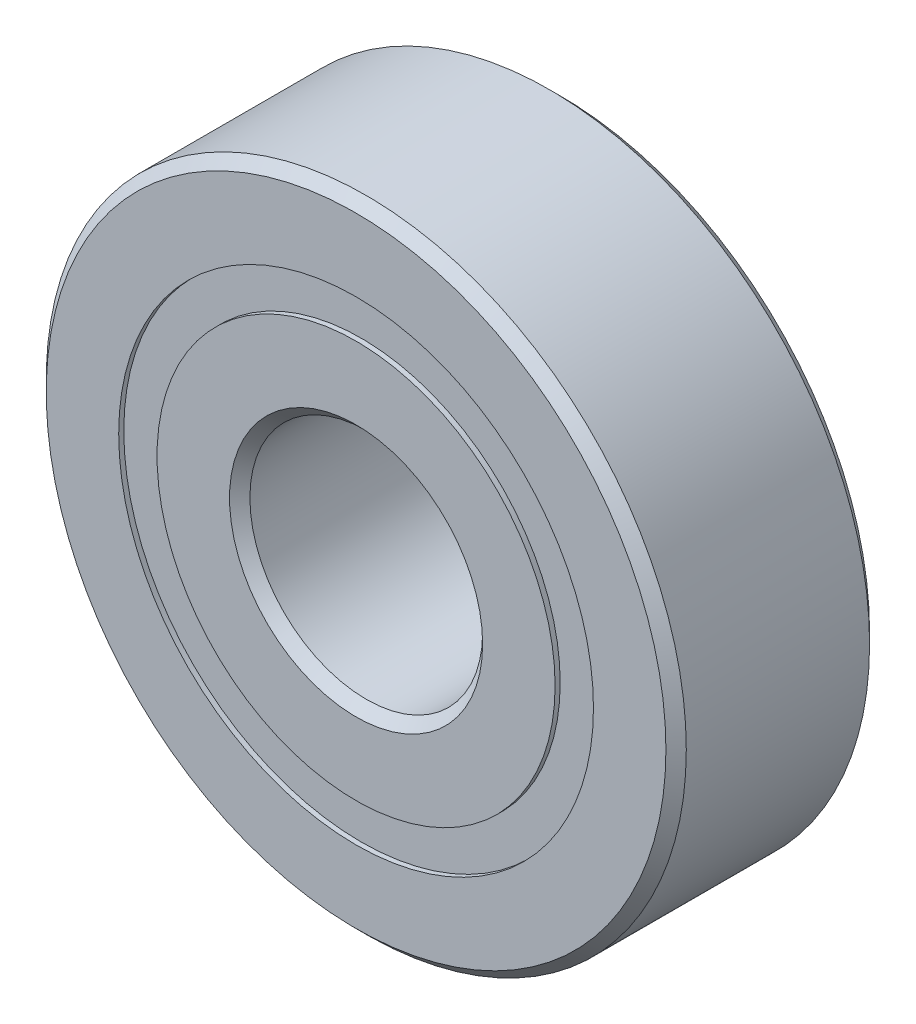
ISO-10303-21;
HEADER;
FILE_DESCRIPTION(('STEP AP214'),'2;1');
FILE_NAME('part.step','',(''),(''),'','','');
FILE_SCHEMA(('AUTOMOTIVE_DESIGN { 1 0 10303 214 1 1 1 1 }'));
ENDSEC;
DATA;
#1=APPLICATION_CONTEXT('core data for automotive mechanical design processes');
#2=APPLICATION_PROTOCOL_DEFINITION('international standard','automotive_design',2000,#1);
#3=PRODUCT_CONTEXT('',#1,'mechanical');
#4=PRODUCT('Part','Part','',(#3));
#5=PRODUCT_RELATED_PRODUCT_CATEGORY('part','',(#4));
#6=PRODUCT_DEFINITION_FORMATION('','',#4);
#7=PRODUCT_DEFINITION_CONTEXT('part definition',#1,'design');
#8=PRODUCT_DEFINITION('design','',#6,#7);
#9=PRODUCT_DEFINITION_SHAPE('','',#8);
#10=(LENGTH_UNIT() NAMED_UNIT(*) SI_UNIT(.MILLI.,.METRE.));
#11=(NAMED_UNIT(*) PLANE_ANGLE_UNIT() SI_UNIT($,.RADIAN.));
#12=(NAMED_UNIT(*) SI_UNIT($,.STERADIAN.) SOLID_ANGLE_UNIT());
#13=UNCERTAINTY_MEASURE_WITH_UNIT(LENGTH_MEASURE(1.E-05),#10,'distance_accuracy_value','');
#14=(GEOMETRIC_REPRESENTATION_CONTEXT(3) GLOBAL_UNCERTAINTY_ASSIGNED_CONTEXT((#13)) GLOBAL_UNIT_ASSIGNED_CONTEXT((#10,
#11,#12)) REPRESENTATION_CONTEXT('',''));
#15=CARTESIAN_POINT('',(0.,0.,0.));
#16=DIRECTION('',(0.,0.,1.));
#17=DIRECTION('',(1.,0.,0.));
#18=AXIS2_PLACEMENT_3D('',#15,#16,#17);
#19=CARTESIAN_POINT('',(0.,8.15934065934066,-3.325));
#20=DIRECTION('',(0.,0.,1.));
#21=DIRECTION('',(1.,0.,0.));
#22=AXIS2_PLACEMENT_3D('',#19,#20,#21);
#23=PLANE('',#22);
#24=CARTESIAN_POINT('',(0.,0.,-3.325));
#25=DIRECTION('',(0.,0.,1.));
#26=DIRECTION('',(1.,0.,0.));
#27=AXIS2_PLACEMENT_3D('',#24,#25,#26);
#28=CIRCLE('',#27,8.15934065934066);
#29=CARTESIAN_POINT('',(8.15934065934066,0.,-3.325));
#30=VERTEX_POINT('',#29);
#31=EDGE_CURVE('E55',#30,#30,#28,.T.);
#32=ORIENTED_EDGE('',*,*,#31,.F.);
#33=EDGE_LOOP('',(#32));
#34=FACE_BOUND('',#33,.T.);
#35=CARTESIAN_POINT('',(0.,0.,-3.325));
#36=DIRECTION('',(0.,0.,1.));
#37=DIRECTION('',(1.,0.,0.));
#38=AXIS2_PLACEMENT_3D('',#35,#36,#37);
#39=CIRCLE('',#38,6.84065934065934);
#40=CARTESIAN_POINT('',(6.84065934065934,0.,-3.325));
#41=VERTEX_POINT('',#40);
#42=EDGE_CURVE('E11',#41,#41,#39,.T.);
#43=ORIENTED_EDGE('',*,*,#42,.T.);
#44=EDGE_LOOP('',(#43));
#45=FACE_BOUND('',#44,.T.);
#46=ADVANCED_FACE('F41',(#34,#45),#23,.F.);
#47=CARTESIAN_POINT('',(0.,0.,3.5));
#48=DIRECTION('',(0.,0.,1.));
#49=DIRECTION('',(1.,0.,0.));
#50=AXIS2_PLACEMENT_3D('',#47,#48,#49);
#51=CYLINDRICAL_SURFACE('',#50,6.84065934065934);
#52=ORIENTED_EDGE('',*,*,#42,.F.);
#53=EDGE_LOOP('',(#52));
#54=FACE_BOUND('',#53,.T.);
#55=CARTESIAN_POINT('',(0.,0.,-1.68952158656808));
#56=DIRECTION('',(0.,0.,1.));
#57=DIRECTION('',(1.,0.,0.));
#58=AXIS2_PLACEMENT_3D('',#55,#56,#57);
#59=CIRCLE('',#58,6.84065934065934);
#60=CARTESIAN_POINT('',(6.84065934065934,0.,-1.68952158656808));
#61=VERTEX_POINT('',#60);
#62=EDGE_CURVE('E47',#61,#61,#59,.T.);
#63=ORIENTED_EDGE('',*,*,#62,.T.);
#64=EDGE_LOOP('',(#63));
#65=FACE_BOUND('',#64,.T.);
#66=ADVANCED_FACE('F64',(#54,#65),#51,.F.);
#67=CARTESIAN_POINT('',(0.,8.15934065934066,-1.68952158656808));
#68=DIRECTION('',(0.,0.,-1.));
#69=DIRECTION('',(-1.,0.,0.));
#70=AXIS2_PLACEMENT_3D('',#67,#68,#69);
#71=PLANE('',#70);
#72=ORIENTED_EDGE('',*,*,#62,.F.);
#73=EDGE_LOOP('',(#72));
#74=FACE_BOUND('',#73,.T.);
#75=CARTESIAN_POINT('',(0.,0.,-1.68952158656808));
#76=DIRECTION('',(0.,0.,1.));
#77=DIRECTION('',(1.,0.,0.));
#78=AXIS2_PLACEMENT_3D('',#75,#76,#77);
#79=CIRCLE('',#78,8.15934065934066);
#80=CARTESIAN_POINT('',(8.15934065934066,0.,-1.68952158656808));
#81=VERTEX_POINT('',#80);
#82=EDGE_CURVE('E51',#81,#81,#79,.T.);
#83=ORIENTED_EDGE('',*,*,#82,.T.);
#84=EDGE_LOOP('',(#83));
#85=FACE_BOUND('',#84,.T.);
#86=ADVANCED_FACE('F68',(#74,#85),#71,.F.);
#87=CARTESIAN_POINT('',(0.,0.,3.5));
#88=DIRECTION('',(0.,0.,1.));
#89=DIRECTION('',(1.,0.,0.));
#90=AXIS2_PLACEMENT_3D('',#87,#88,#89);
#91=CYLINDRICAL_SURFACE('',#90,8.15934065934066);
#92=ORIENTED_EDGE('',*,*,#82,.F.);
#93=EDGE_LOOP('',(#92));
#94=FACE_BOUND('',#93,.T.);
#95=ORIENTED_EDGE('',*,*,#31,.T.);
#96=EDGE_LOOP('',(#95));
#97=FACE_BOUND('',#96,.T.);
#98=ADVANCED_FACE('F61',(#94,#97),#91,.T.);
#99=CLOSED_SHELL('',(#46,#66,#86,#98));
#100=MANIFOLD_SOLID_BREP('B2',#99);
#101=CARTESIAN_POINT('',(0.,8.15934065934066,3.325));
#102=DIRECTION('',(0.,0.,-1.));
#103=DIRECTION('',(-1.,0.,0.));
#104=AXIS2_PLACEMENT_3D('',#101,#102,#103);
#105=PLANE('',#104);
#106=CARTESIAN_POINT('',(0.,0.,3.325));
#107=DIRECTION('',(0.,0.,1.));
#108=DIRECTION('',(1.,0.,0.));
#109=AXIS2_PLACEMENT_3D('',#106,#107,#108);
#110=CIRCLE('',#109,6.84065934065934);
#111=CARTESIAN_POINT('',(6.84065934065934,0.,3.325));
#112=VERTEX_POINT('',#111);
#113=EDGE_CURVE('E40',#112,#112,#110,.T.);
#114=ORIENTED_EDGE('',*,*,#113,.F.);
#115=EDGE_LOOP('',(#114));
#116=FACE_BOUND('',#115,.T.);
#117=CARTESIAN_POINT('',(0.,0.,3.325));
#118=DIRECTION('',(0.,0.,1.));
#119=DIRECTION('',(1.,0.,0.));
#120=AXIS2_PLACEMENT_3D('',#117,#118,#119);
#121=CIRCLE('',#120,8.15934065934066);
#122=CARTESIAN_POINT('',(8.15934065934066,0.,3.325));
#123=VERTEX_POINT('',#122);
#124=EDGE_CURVE('E122',#123,#123,#121,.T.);
#125=ORIENTED_EDGE('',*,*,#124,.T.);
#126=EDGE_LOOP('',(#125));
#127=FACE_BOUND('',#126,.T.);
#128=ADVANCED_FACE('F108',(#116,#127),#105,.F.);
#129=CARTESIAN_POINT('',(0.,0.,3.5));
#130=DIRECTION('',(0.,0.,1.));
#131=DIRECTION('',(1.,0.,0.));
#132=AXIS2_PLACEMENT_3D('',#129,#130,#131);
#133=CYLINDRICAL_SURFACE('',#132,6.84065934065934);
#134=CARTESIAN_POINT('',(0.,0.,1.68952158656808));
#135=DIRECTION('',(0.,0.,1.));
#136=DIRECTION('',(1.,0.,0.));
#137=AXIS2_PLACEMENT_3D('',#134,#135,#136);
#138=CIRCLE('',#137,6.84065934065934);
#139=CARTESIAN_POINT('',(6.84065934065934,0.,1.68952158656808));
#140=VERTEX_POINT('',#139);
#141=EDGE_CURVE('E114',#140,#140,#138,.T.);
#142=ORIENTED_EDGE('',*,*,#141,.F.);
#143=EDGE_LOOP('',(#142));
#144=FACE_BOUND('',#143,.T.);
#145=ORIENTED_EDGE('',*,*,#113,.T.);
#146=EDGE_LOOP('',(#145));
#147=FACE_BOUND('',#146,.T.);
#148=ADVANCED_FACE('F137',(#144,#147),#133,.F.);
#149=CARTESIAN_POINT('',(0.,8.15934065934066,1.68952158656808));
#150=DIRECTION('',(0.,0.,1.));
#151=DIRECTION('',(1.,0.,0.));
#152=AXIS2_PLACEMENT_3D('',#149,#150,#151);
#153=PLANE('',#152);
#154=CARTESIAN_POINT('',(0.,0.,1.68952158656808));
#155=DIRECTION('',(0.,0.,1.));
#156=DIRECTION('',(1.,0.,0.));
#157=AXIS2_PLACEMENT_3D('',#154,#155,#156);
#158=CIRCLE('',#157,8.15934065934066);
#159=CARTESIAN_POINT('',(8.15934065934066,0.,1.68952158656808));
#160=VERTEX_POINT('',#159);
#161=EDGE_CURVE('E118',#160,#160,#158,.T.);
#162=ORIENTED_EDGE('',*,*,#161,.F.);
#163=EDGE_LOOP('',(#162));
#164=FACE_BOUND('',#163,.T.);
#165=ORIENTED_EDGE('',*,*,#141,.T.);
#166=EDGE_LOOP('',(#165));
#167=FACE_BOUND('',#166,.T.);
#168=ADVANCED_FACE('F132',(#164,#167),#153,.F.);
#169=CARTESIAN_POINT('',(0.,0.,3.5));
#170=DIRECTION('',(0.,0.,1.));
#171=DIRECTION('',(1.,0.,0.));
#172=AXIS2_PLACEMENT_3D('',#169,#170,#171);
#173=CYLINDRICAL_SURFACE('',#172,8.15934065934066);
#174=ORIENTED_EDGE('',*,*,#124,.F.);
#175=EDGE_LOOP('',(#174));
#176=FACE_BOUND('',#175,.T.);
#177=ORIENTED_EDGE('',*,*,#161,.T.);
#178=EDGE_LOOP('',(#177));
#179=FACE_BOUND('',#178,.T.);
#180=ADVANCED_FACE('F129',(#176,#179),#173,.T.);
#181=CLOSED_SHELL('',(#128,#148,#168,#180));
#182=MANIFOLD_SOLID_BREP('B6',#181);
#183=CARTESIAN_POINT('',(-3.74999999999992,6.49519052838334,0.));
#184=DIRECTION('',(0.,0.,1.));
#185=DIRECTION('',(-0.499999999999989,0.866025403784445,0.));
#186=AXIS2_PLACEMENT_3D('',#183,#184,#185);
#187=SPHERICAL_SURFACE('',#186,1.68952158656808);
#188=CARTESIAN_POINT('',(-3.74999999999992,6.49519052838334,1.68952158656808));
#189=VERTEX_POINT('',#188);
#190=VERTEX_LOOP('',#189);
#191=FACE_BOUND('',#190,.T.);
#192=ADVANCED_FACE('F175',(#191),#187,.T.);
#193=CLOSED_SHELL('',(#192));
#194=MANIFOLD_SOLID_BREP('B35',#193);
#195=CARTESIAN_POINT('',(-6.49519052838325,3.75000000000008,0.));
#196=DIRECTION('',(0.,0.,1.));
#197=DIRECTION('',(-0.866025403784433,0.50000000000001,0.));
#198=AXIS2_PLACEMENT_3D('',#195,#196,#197);
#199=SPHERICAL_SURFACE('',#198,1.68952158656808);
#200=CARTESIAN_POINT('',(-6.49519052838325,3.75000000000008,1.68952158656808));
#201=VERTEX_POINT('',#200);
#202=VERTEX_LOOP('',#201);
#203=FACE_BOUND('',#202,.T.);
#204=ADVANCED_FACE('F195',(#203),#199,.T.);
#205=CLOSED_SHELL('',(#204));
#206=MANIFOLD_SOLID_BREP('B104',#205);
#207=CARTESIAN_POINT('',(-7.5,0.,0.));
#208=DIRECTION('',(0.,0.,1.));
#209=DIRECTION('',(-1.,0.,0.));
#210=AXIS2_PLACEMENT_3D('',#207,#208,#209);
#211=SPHERICAL_SURFACE('',#210,1.68952158656808);
#212=CARTESIAN_POINT('',(-7.5,0.,1.68952158656808));
#213=VERTEX_POINT('',#212);
#214=VERTEX_LOOP('',#213);
#215=FACE_BOUND('',#214,.T.);
#216=ADVANCED_FACE('F215',(#215),#211,.T.);
#217=CLOSED_SHELL('',(#216));
#218=MANIFOLD_SOLID_BREP('B171',#217);
#219=CARTESIAN_POINT('',(-6.49519052838332,-3.74999999999994,0.));
#220=DIRECTION('',(0.,0.,1.));
#221=DIRECTION('',(-0.866025403784443,-0.499999999999992,0.));
#222=AXIS2_PLACEMENT_3D('',#219,#220,#221);
#223=SPHERICAL_SURFACE('',#222,1.68952158656808);
#224=CARTESIAN_POINT('',(-6.49519052838332,-3.74999999999994,1.68952158656808));
#225=VERTEX_POINT('',#224);
#226=VERTEX_LOOP('',#225);
#227=FACE_BOUND('',#226,.T.);
#228=ADVANCED_FACE('F235',(#227),#223,.T.);
#229=CLOSED_SHELL('',(#228));
#230=MANIFOLD_SOLID_BREP('B191',#229);
#231=CARTESIAN_POINT('',(-3.75000000000005,-6.49519052838326,0.));
#232=DIRECTION('',(0.,0.,1.));
#233=DIRECTION('',(-0.500000000000007,-0.866025403784435,0.));
#234=AXIS2_PLACEMENT_3D('',#231,#232,#233);
#235=SPHERICAL_SURFACE('',#234,1.68952158656808);
#236=CARTESIAN_POINT('',(-3.75000000000005,-6.49519052838326,1.68952158656808));
#237=VERTEX_POINT('',#236);
#238=VERTEX_LOOP('',#237);
#239=FACE_BOUND('',#238,.T.);
#240=ADVANCED_FACE('F255',(#239),#235,.T.);
#241=CLOSED_SHELL('',(#240));
#242=MANIFOLD_SOLID_BREP('B211',#241);
#243=CARTESIAN_POINT('',(0.,-7.5,0.));
#244=DIRECTION('',(0.,0.,1.));
#245=DIRECTION('',(0.,-1.,0.));
#246=AXIS2_PLACEMENT_3D('',#243,#244,#245);
#247=SPHERICAL_SURFACE('',#246,1.68952158656808);
#248=CARTESIAN_POINT('',(0.,-7.5,1.68952158656808));
#249=VERTEX_POINT('',#248);
#250=VERTEX_LOOP('',#249);
#251=FACE_BOUND('',#250,.T.);
#252=ADVANCED_FACE('F275',(#251),#247,.T.);
#253=CLOSED_SHELL('',(#252));
#254=MANIFOLD_SOLID_BREP('B231',#253);
#255=CARTESIAN_POINT('',(3.74999999999996,-6.49519052838331,0.));
#256=DIRECTION('',(0.,0.,1.));
#257=DIRECTION('',(0.499999999999995,-0.866025403784442,0.));
#258=AXIS2_PLACEMENT_3D('',#255,#256,#257);
#259=SPHERICAL_SURFACE('',#258,1.68952158656808);
#260=CARTESIAN_POINT('',(3.74999999999996,-6.49519052838331,1.68952158656808));
#261=VERTEX_POINT('',#260);
#262=VERTEX_LOOP('',#261);
#263=FACE_BOUND('',#262,.T.);
#264=ADVANCED_FACE('F295',(#263),#259,.T.);
#265=CLOSED_SHELL('',(#264));
#266=MANIFOLD_SOLID_BREP('B251',#265);
#267=CARTESIAN_POINT('',(6.49519052838327,-3.75000000000003,0.));
#268=DIRECTION('',(0.,0.,1.));
#269=DIRECTION('',(0.866025403784436,-0.500000000000004,0.));
#270=AXIS2_PLACEMENT_3D('',#267,#268,#269);
#271=SPHERICAL_SURFACE('',#270,1.68952158656808);
#272=CARTESIAN_POINT('',(6.49519052838327,-3.75000000000003,1.68952158656808));
#273=VERTEX_POINT('',#272);
#274=VERTEX_LOOP('',#273);
#275=FACE_BOUND('',#274,.T.);
#276=ADVANCED_FACE('F315',(#275),#271,.T.);
#277=CLOSED_SHELL('',(#276));
#278=MANIFOLD_SOLID_BREP('B271',#277);
#279=CARTESIAN_POINT('',(7.5,0.,0.));
#280=DIRECTION('',(0.,0.,1.));
#281=DIRECTION('',(1.,0.,0.));
#282=AXIS2_PLACEMENT_3D('',#279,#280,#281);
#283=SPHERICAL_SURFACE('',#282,1.68952158656808);
#284=CARTESIAN_POINT('',(7.5,0.,1.68952158656808));
#285=VERTEX_POINT('',#284);
#286=VERTEX_LOOP('',#285);
#287=FACE_BOUND('',#286,.T.);
#288=ADVANCED_FACE('F335',(#287),#283,.T.);
#289=CLOSED_SHELL('',(#288));
#290=MANIFOLD_SOLID_BREP('B291',#289);
#291=CARTESIAN_POINT('',(6.4951905283833,3.74999999999998,0.));
#292=DIRECTION('',(0.,0.,1.));
#293=DIRECTION('',(0.86602540378444,0.499999999999998,0.));
#294=AXIS2_PLACEMENT_3D('',#291,#292,#293);
#295=SPHERICAL_SURFACE('',#294,1.68952158656808);
#296=CARTESIAN_POINT('',(6.4951905283833,3.74999999999998,1.68952158656808));
#297=VERTEX_POINT('',#296);
#298=VERTEX_LOOP('',#297);
#299=FACE_BOUND('',#298,.T.);
#300=ADVANCED_FACE('F355',(#299),#295,.T.);
#301=CLOSED_SHELL('',(#300));
#302=MANIFOLD_SOLID_BREP('B311',#301);
#303=CARTESIAN_POINT('',(3.75000000000001,6.49519052838328,0.));
#304=DIRECTION('',(0.,0.,1.));
#305=DIRECTION('',(0.500000000000001,0.866025403784438,0.));
#306=AXIS2_PLACEMENT_3D('',#303,#304,#305);
#307=SPHERICAL_SURFACE('',#306,1.68952158656808);
#308=CARTESIAN_POINT('',(3.75000000000001,6.49519052838328,1.68952158656808));
#309=VERTEX_POINT('',#308);
#310=VERTEX_LOOP('',#309);
#311=FACE_BOUND('',#310,.T.);
#312=ADVANCED_FACE('F375',(#311),#307,.T.);
#313=CLOSED_SHELL('',(#312));
#314=MANIFOLD_SOLID_BREP('B331',#313);
#315=CARTESIAN_POINT('',(0.,7.5,0.));
#316=DIRECTION('',(0.,0.,1.));
#317=DIRECTION('',(0.,1.,0.));
#318=AXIS2_PLACEMENT_3D('',#315,#316,#317);
#319=SPHERICAL_SURFACE('',#318,1.68952158656808);
#320=CARTESIAN_POINT('',(0.,7.5,1.68952158656808));
#321=VERTEX_POINT('',#320);
#322=VERTEX_LOOP('',#321);
#323=FACE_BOUND('',#322,.T.);
#324=ADVANCED_FACE('F397',(#323),#319,.T.);
#325=CLOSED_SHELL('',(#324));
#326=MANIFOLD_SOLID_BREP('B351',#325);
#327=CARTESIAN_POINT('',(0.,6.84065934065934,3.5));
#328=DIRECTION('',(0.,0.,-1.));
#329=DIRECTION('',(-1.,0.,0.));
#330=AXIS2_PLACEMENT_3D('',#327,#328,#329);
#331=PLANE('',#330);
#332=CARTESIAN_POINT('',(0.,0.,3.5));
#333=DIRECTION('',(0.,0.,1.));
#334=DIRECTION('',(1.,0.,0.));
#335=AXIS2_PLACEMENT_3D('',#332,#333,#334);
#336=CIRCLE('',#335,4.35);
#337=CARTESIAN_POINT('',(4.35,0.,3.5));
#338=VERTEX_POINT('',#337);
#339=EDGE_CURVE('E444',#338,#338,#336,.T.);
#340=ORIENTED_EDGE('',*,*,#339,.F.);
#341=EDGE_LOOP('',(#340));
#342=FACE_BOUND('',#341,.T.);
#343=CARTESIAN_POINT('',(0.,0.,3.5));
#344=DIRECTION('',(0.,0.,1.));
#345=DIRECTION('',(1.,0.,0.));
#346=AXIS2_PLACEMENT_3D('',#343,#344,#345);
#347=CIRCLE('',#346,6.84065934065934);
#348=CARTESIAN_POINT('',(6.84065934065934,0.,3.5));
#349=VERTEX_POINT('',#348);
#350=EDGE_CURVE('E396',#349,#349,#347,.T.);
#351=ORIENTED_EDGE('',*,*,#350,.T.);
#352=EDGE_LOOP('',(#351));
#353=FACE_BOUND('',#352,.T.);
#354=ADVANCED_FACE('F416',(#342,#353),#331,.F.);
#355=CARTESIAN_POINT('',(0.,0.,3.5));
#356=DIRECTION('',(0.,0.,1.));
#357=DIRECTION('',(1.,0.,0.));
#358=AXIS2_PLACEMENT_3D('',#355,#356,#357);
#359=CYLINDRICAL_SURFACE('',#358,6.84065934065934);
#360=ORIENTED_EDGE('',*,*,#350,.F.);
#361=EDGE_LOOP('',(#360));
#362=FACE_BOUND('',#361,.T.);
#363=CARTESIAN_POINT('',(0.,0.,1.55555555555556));
#364=DIRECTION('',(0.,0.,1.));
#365=DIRECTION('',(1.,0.,0.));
#366=AXIS2_PLACEMENT_3D('',#363,#364,#365);
#367=CIRCLE('',#366,6.84065934065934);
#368=CARTESIAN_POINT('',(6.84065934065934,0.,1.55555555555556));
#369=VERTEX_POINT('',#368);
#370=EDGE_CURVE('E422',#369,#369,#367,.T.);
#371=ORIENTED_EDGE('',*,*,#370,.T.);
#372=EDGE_LOOP('',(#371));
#373=FACE_BOUND('',#372,.T.);
#374=ADVANCED_FACE('F451',(#362,#373),#359,.T.);
#375=CARTESIAN_POINT('',(0.,0.,0.));
#376=DIRECTION('',(0.,0.,1.));
#377=DIRECTION('',(1.,0.,0.));
#378=AXIS2_PLACEMENT_3D('',#375,#376,#377);
#379=TOROIDAL_SURFACE('',#378,7.49999999999999,1.68952158656808);
#380=ORIENTED_EDGE('',*,*,#370,.F.);
#381=EDGE_LOOP('',(#380));
#382=FACE_BOUND('',#381,.T.);
#383=CARTESIAN_POINT('',(0.,0.,-1.55555555555556));
#384=DIRECTION('',(0.,0.,1.));
#385=DIRECTION('',(1.,0.,0.));
#386=AXIS2_PLACEMENT_3D('',#383,#384,#385);
#387=CIRCLE('',#386,6.84065934065934);
#388=CARTESIAN_POINT('',(6.84065934065934,0.,-1.55555555555556));
#389=VERTEX_POINT('',#388);
#390=EDGE_CURVE('E426',#389,#389,#387,.T.);
#391=ORIENTED_EDGE('',*,*,#390,.T.);
#392=EDGE_LOOP('',(#391));
#393=FACE_BOUND('',#392,.T.);
#394=ADVANCED_FACE('F455',(#382,#393),#379,.F.);
#395=CARTESIAN_POINT('',(0.,0.,3.5));
#396=DIRECTION('',(0.,0.,1.));
#397=DIRECTION('',(1.,0.,0.));
#398=AXIS2_PLACEMENT_3D('',#395,#396,#397);
#399=CYLINDRICAL_SURFACE('',#398,6.84065934065934);
#400=ORIENTED_EDGE('',*,*,#390,.F.);
#401=EDGE_LOOP('',(#400));
#402=FACE_BOUND('',#401,.T.);
#403=CARTESIAN_POINT('',(0.,0.,-3.5));
#404=DIRECTION('',(0.,0.,1.));
#405=DIRECTION('',(1.,0.,0.));
#406=AXIS2_PLACEMENT_3D('',#403,#404,#405);
#407=CIRCLE('',#406,6.84065934065934);
#408=CARTESIAN_POINT('',(6.84065934065934,0.,-3.5));
#409=VERTEX_POINT('',#408);
#410=EDGE_CURVE('E430',#409,#409,#407,.T.);
#411=ORIENTED_EDGE('',*,*,#410,.T.);
#412=EDGE_LOOP('',(#411));
#413=FACE_BOUND('',#412,.T.);
#414=ADVANCED_FACE('F460',(#402,#413),#399,.T.);
#415=CARTESIAN_POINT('',(0.,4.35,-3.5));
#416=DIRECTION('',(0.,0.,1.));
#417=DIRECTION('',(1.,0.,0.));
#418=AXIS2_PLACEMENT_3D('',#415,#416,#417);
#419=PLANE('',#418);
#420=ORIENTED_EDGE('',*,*,#410,.F.);
#421=EDGE_LOOP('',(#420));
#422=FACE_BOUND('',#421,.T.);
#423=CARTESIAN_POINT('',(0.,0.,-3.5));
#424=DIRECTION('',(0.,0.,1.));
#425=DIRECTION('',(1.,0.,0.));
#426=AXIS2_PLACEMENT_3D('',#423,#424,#425);
#427=CIRCLE('',#426,4.35);
#428=CARTESIAN_POINT('',(4.35,0.,-3.5));
#429=VERTEX_POINT('',#428);
#430=EDGE_CURVE('E435',#429,#429,#427,.T.);
#431=ORIENTED_EDGE('',*,*,#430,.T.);
#432=EDGE_LOOP('',(#431));
#433=FACE_BOUND('',#432,.T.);
#434=ADVANCED_FACE('F466',(#422,#433),#419,.F.);
#435=CARTESIAN_POINT('',(0.,0.,-3.15));
#436=DIRECTION('',(0.,0.,-1.));
#437=DIRECTION('',(-1.,0.,0.));
#438=AXIS2_PLACEMENT_3D('',#435,#436,#437);
#439=CONICAL_SURFACE('',#438,4.,0.785398163397451);
#440=ORIENTED_EDGE('',*,*,#430,.F.);
#441=EDGE_LOOP('',(#440));
#442=FACE_BOUND('',#441,.T.);
#443=CARTESIAN_POINT('',(0.,0.,-3.15));
#444=DIRECTION('',(0.,0.,1.));
#445=DIRECTION('',(1.,0.,0.));
#446=AXIS2_PLACEMENT_3D('',#443,#444,#445);
#447=CIRCLE('',#446,4.);
#448=CARTESIAN_POINT('',(4.,0.,-3.15));
#449=VERTEX_POINT('',#448);
#450=EDGE_CURVE('E438',#449,#449,#447,.T.);
#451=ORIENTED_EDGE('',*,*,#450,.T.);
#452=EDGE_LOOP('',(#451));
#453=FACE_BOUND('',#452,.T.);
#454=ADVANCED_FACE('F470',(#442,#453),#439,.F.);
#455=CARTESIAN_POINT('',(0.,0.,3.5));
#456=DIRECTION('',(0.,0.,1.));
#457=DIRECTION('',(1.,0.,0.));
#458=AXIS2_PLACEMENT_3D('',#455,#456,#457);
#459=CYLINDRICAL_SURFACE('',#458,4.);
#460=ORIENTED_EDGE('',*,*,#450,.F.);
#461=EDGE_LOOP('',(#460));
#462=FACE_BOUND('',#461,.T.);
#463=CARTESIAN_POINT('',(0.,0.,3.15));
#464=DIRECTION('',(0.,0.,1.));
#465=DIRECTION('',(1.,0.,0.));
#466=AXIS2_PLACEMENT_3D('',#463,#464,#465);
#467=CIRCLE('',#466,4.);
#468=CARTESIAN_POINT('',(4.,0.,3.15));
#469=VERTEX_POINT('',#468);
#470=EDGE_CURVE('E441',#469,#469,#467,.T.);
#471=ORIENTED_EDGE('',*,*,#470,.T.);
#472=EDGE_LOOP('',(#471));
#473=FACE_BOUND('',#472,.T.);
#474=ADVANCED_FACE('F474',(#462,#473),#459,.F.);
#475=CARTESIAN_POINT('',(0.,0.,3.5));
#476=DIRECTION('',(0.,0.,1.));
#477=DIRECTION('',(1.,0.,0.));
#478=AXIS2_PLACEMENT_3D('',#475,#476,#477);
#479=CONICAL_SURFACE('',#478,4.35,0.785398163397447);
#480=ORIENTED_EDGE('',*,*,#470,.F.);
#481=EDGE_LOOP('',(#480));
#482=FACE_BOUND('',#481,.T.);
#483=ORIENTED_EDGE('',*,*,#339,.T.);
#484=EDGE_LOOP('',(#483));
#485=FACE_BOUND('',#484,.T.);
#486=ADVANCED_FACE('F448',(#482,#485),#479,.F.);
#487=CLOSED_SHELL('',(#354,#374,#394,#414,#434,#454,#474,#486));
#488=MANIFOLD_SOLID_BREP('B371',#487);
#489=CARTESIAN_POINT('',(0.,0.,3.15));
#490=DIRECTION('',(0.,0.,-1.));
#491=DIRECTION('',(-1.,0.,0.));
#492=AXIS2_PLACEMENT_3D('',#489,#490,#491);
#493=CONICAL_SURFACE('',#492,11.,0.78539816339745);
#494=CARTESIAN_POINT('',(0.,0.,3.5));
#495=DIRECTION('',(0.,0.,1.));
#496=DIRECTION('',(1.,0.,0.));
#497=AXIS2_PLACEMENT_3D('',#494,#495,#496);
#498=CIRCLE('',#497,10.65);
#499=CARTESIAN_POINT('',(10.65,0.,3.5));
#500=VERTEX_POINT('',#499);
#501=EDGE_CURVE('E565',#500,#500,#498,.T.);
#502=ORIENTED_EDGE('',*,*,#501,.F.);
#503=EDGE_LOOP('',(#502));
#504=FACE_BOUND('',#503,.T.);
#505=CARTESIAN_POINT('',(0.,0.,3.15));
#506=DIRECTION('',(0.,0.,1.));
#507=DIRECTION('',(1.,0.,0.));
#508=AXIS2_PLACEMENT_3D('',#505,#506,#507);
#509=CIRCLE('',#508,11.);
#510=CARTESIAN_POINT('',(11.,0.,3.15));
#511=VERTEX_POINT('',#510);
#512=EDGE_CURVE('E415',#511,#511,#509,.T.);
#513=ORIENTED_EDGE('',*,*,#512,.T.);
#514=EDGE_LOOP('',(#513));
#515=FACE_BOUND('',#514,.T.);
#516=ADVANCED_FACE('F537',(#504,#515),#493,.T.);
#517=CARTESIAN_POINT('',(0.,0.,3.5));
#518=DIRECTION('',(0.,0.,1.));
#519=DIRECTION('',(1.,0.,0.));
#520=AXIS2_PLACEMENT_3D('',#517,#518,#519);
#521=CYLINDRICAL_SURFACE('',#520,11.);
#522=ORIENTED_EDGE('',*,*,#512,.F.);
#523=EDGE_LOOP('',(#522));
#524=FACE_BOUND('',#523,.T.);
#525=CARTESIAN_POINT('',(0.,0.,-3.15));
#526=DIRECTION('',(0.,0.,1.));
#527=DIRECTION('',(1.,0.,0.));
#528=AXIS2_PLACEMENT_3D('',#525,#526,#527);
#529=CIRCLE('',#528,11.);
#530=CARTESIAN_POINT('',(11.,0.,-3.15));
#531=VERTEX_POINT('',#530);
#532=EDGE_CURVE('E543',#531,#531,#529,.T.);
#533=ORIENTED_EDGE('',*,*,#532,.T.);
#534=EDGE_LOOP('',(#533));
#535=FACE_BOUND('',#534,.T.);
#536=ADVANCED_FACE('F572',(#524,#535),#521,.T.);
#537=CARTESIAN_POINT('',(0.,0.,-3.5));
#538=DIRECTION('',(0.,0.,1.));
#539=DIRECTION('',(1.,0.,0.));
#540=AXIS2_PLACEMENT_3D('',#537,#538,#539);
#541=CONICAL_SURFACE('',#540,10.65,0.785398163397448);
#542=ORIENTED_EDGE('',*,*,#532,.F.);
#543=EDGE_LOOP('',(#542));
#544=FACE_BOUND('',#543,.T.);
#545=CARTESIAN_POINT('',(0.,0.,-3.5));
#546=DIRECTION('',(0.,0.,1.));
#547=DIRECTION('',(1.,0.,0.));
#548=AXIS2_PLACEMENT_3D('',#545,#546,#547);
#549=CIRCLE('',#548,10.65);
#550=CARTESIAN_POINT('',(10.65,0.,-3.5));
#551=VERTEX_POINT('',#550);
#552=EDGE_CURVE('E547',#551,#551,#549,.T.);
#553=ORIENTED_EDGE('',*,*,#552,.T.);
#554=EDGE_LOOP('',(#553));
#555=FACE_BOUND('',#554,.T.);
#556=ADVANCED_FACE('F576',(#544,#555),#541,.T.);
#557=CARTESIAN_POINT('',(0.,10.65,-3.5));
#558=DIRECTION('',(0.,0.,1.));
#559=DIRECTION('',(1.,0.,0.));
#560=AXIS2_PLACEMENT_3D('',#557,#558,#559);
#561=PLANE('',#560);
#562=ORIENTED_EDGE('',*,*,#552,.F.);
#563=EDGE_LOOP('',(#562));
#564=FACE_BOUND('',#563,.T.);
#565=CARTESIAN_POINT('',(0.,0.,-3.5));
#566=DIRECTION('',(0.,0.,1.));
#567=DIRECTION('',(1.,0.,0.));
#568=AXIS2_PLACEMENT_3D('',#565,#566,#567);
#569=CIRCLE('',#568,8.15934065934066);
#570=CARTESIAN_POINT('',(8.15934065934066,0.,-3.5));
#571=VERTEX_POINT('',#570);
#572=EDGE_CURVE('E551',#571,#571,#569,.T.);
#573=ORIENTED_EDGE('',*,*,#572,.T.);
#574=EDGE_LOOP('',(#573));
#575=FACE_BOUND('',#574,.T.);
#576=ADVANCED_FACE('F581',(#564,#575),#561,.F.);
#577=CARTESIAN_POINT('',(0.,0.,3.5));
#578=DIRECTION('',(0.,0.,1.));
#579=DIRECTION('',(1.,0.,0.));
#580=AXIS2_PLACEMENT_3D('',#577,#578,#579);
#581=CYLINDRICAL_SURFACE('',#580,8.15934065934066);
#582=ORIENTED_EDGE('',*,*,#572,.F.);
#583=EDGE_LOOP('',(#582));
#584=FACE_BOUND('',#583,.T.);
#585=CARTESIAN_POINT('',(0.,0.,-1.55555555555556));
#586=DIRECTION('',(0.,0.,1.));
#587=DIRECTION('',(1.,0.,0.));
#588=AXIS2_PLACEMENT_3D('',#585,#586,#587);
#589=CIRCLE('',#588,8.15934065934066);
#590=CARTESIAN_POINT('',(8.15934065934066,0.,-1.55555555555556));
#591=VERTEX_POINT('',#590);
#592=EDGE_CURVE('E556',#591,#591,#589,.T.);
#593=ORIENTED_EDGE('',*,*,#592,.T.);
#594=EDGE_LOOP('',(#593));
#595=FACE_BOUND('',#594,.T.);
#596=ADVANCED_FACE('F587',(#584,#595),#581,.F.);
#597=CARTESIAN_POINT('',(0.,0.,0.));
#598=DIRECTION('',(0.,0.,1.));
#599=DIRECTION('',(1.,0.,0.));
#600=AXIS2_PLACEMENT_3D('',#597,#598,#599);
#601=TOROIDAL_SURFACE('',#600,7.5,1.68952158656808);
#602=ORIENTED_EDGE('',*,*,#592,.F.);
#603=EDGE_LOOP('',(#602));
#604=FACE_BOUND('',#603,.T.);
#605=CARTESIAN_POINT('',(0.,0.,1.55555555555556));
#606=DIRECTION('',(0.,0.,1.));
#607=DIRECTION('',(1.,0.,0.));
#608=AXIS2_PLACEMENT_3D('',#605,#606,#607);
#609=CIRCLE('',#608,8.15934065934066);
#610=CARTESIAN_POINT('',(8.15934065934066,0.,1.55555555555556));
#611=VERTEX_POINT('',#610);
#612=EDGE_CURVE('E559',#611,#611,#609,.T.);
#613=ORIENTED_EDGE('',*,*,#612,.T.);
#614=EDGE_LOOP('',(#613));
#615=FACE_BOUND('',#614,.T.);
#616=ADVANCED_FACE('F591',(#604,#615),#601,.F.);
#617=CARTESIAN_POINT('',(0.,0.,3.5));
#618=DIRECTION('',(0.,0.,1.));
#619=DIRECTION('',(1.,0.,0.));
#620=AXIS2_PLACEMENT_3D('',#617,#618,#619);
#621=CYLINDRICAL_SURFACE('',#620,8.15934065934066);
#622=ORIENTED_EDGE('',*,*,#612,.F.);
#623=EDGE_LOOP('',(#622));
#624=FACE_BOUND('',#623,.T.);
#625=CARTESIAN_POINT('',(0.,0.,3.5));
#626=DIRECTION('',(0.,0.,1.));
#627=DIRECTION('',(1.,0.,0.));
#628=AXIS2_PLACEMENT_3D('',#625,#626,#627);
#629=CIRCLE('',#628,8.15934065934066);
#630=CARTESIAN_POINT('',(8.15934065934066,0.,3.5));
#631=VERTEX_POINT('',#630);
#632=EDGE_CURVE('E562',#631,#631,#629,.T.);
#633=ORIENTED_EDGE('',*,*,#632,.T.);
#634=EDGE_LOOP('',(#633));
#635=FACE_BOUND('',#634,.T.);
#636=ADVANCED_FACE('F595',(#624,#635),#621,.F.);
#637=CARTESIAN_POINT('',(0.,10.65,3.5));
#638=DIRECTION('',(0.,0.,-1.));
#639=DIRECTION('',(-1.,0.,0.));
#640=AXIS2_PLACEMENT_3D('',#637,#638,#639);
#641=PLANE('',#640);
#642=ORIENTED_EDGE('',*,*,#632,.F.);
#643=EDGE_LOOP('',(#642));
#644=FACE_BOUND('',#643,.T.);
#645=ORIENTED_EDGE('',*,*,#501,.T.);
#646=EDGE_LOOP('',(#645));
#647=FACE_BOUND('',#646,.T.);
#648=ADVANCED_FACE('F569',(#644,#647),#641,.F.);
#649=CLOSED_SHELL('',(#516,#536,#556,#576,#596,#616,#636,#648));
#650=MANIFOLD_SOLID_BREP('B391',#649);
#651=ADVANCED_BREP_SHAPE_REPRESENTATION('',(#18,#100,#182,#194,#206,#218,#230,#242,#254,#266,
#278,#290,#302,#314,#326,#488,#650),#14);
#652=SHAPE_DEFINITION_REPRESENTATION(#9,#651);
ENDSEC;
END-ISO-10303-21;
